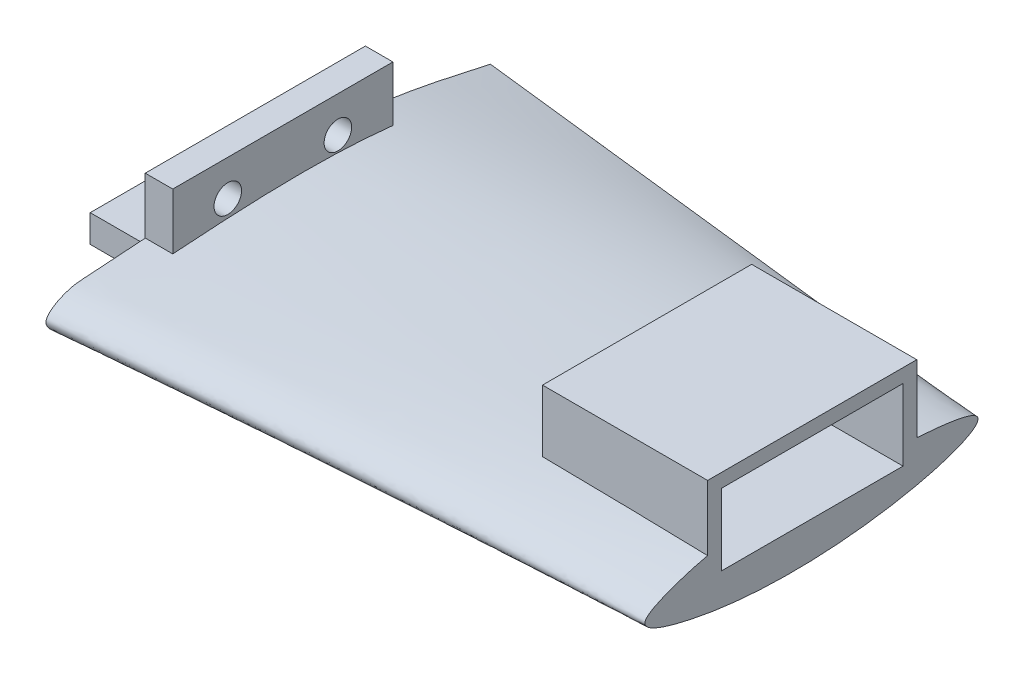
ISO-10303-21;
HEADER;
FILE_DESCRIPTION(('STEP AP214'),'2;1');
FILE_NAME('part.step','',(''),(''),'','','');
FILE_SCHEMA(('AUTOMOTIVE_DESIGN { 1 0 10303 214 1 1 1 1 }'));
ENDSEC;
DATA;
#1=APPLICATION_CONTEXT('core data for automotive mechanical design processes');
#2=APPLICATION_PROTOCOL_DEFINITION('international standard','automotive_design',2000,#1);
#3=PRODUCT_CONTEXT('',#1,'mechanical');
#4=PRODUCT('Part','Part','',(#3));
#5=PRODUCT_RELATED_PRODUCT_CATEGORY('part','',(#4));
#6=PRODUCT_DEFINITION_FORMATION('','',#4);
#7=PRODUCT_DEFINITION_CONTEXT('part definition',#1,'design');
#8=PRODUCT_DEFINITION('design','',#6,#7);
#9=PRODUCT_DEFINITION_SHAPE('','',#8);
#10=(LENGTH_UNIT() NAMED_UNIT(*) SI_UNIT(.MILLI.,.METRE.));
#11=(NAMED_UNIT(*) PLANE_ANGLE_UNIT() SI_UNIT($,.RADIAN.));
#12=(NAMED_UNIT(*) SI_UNIT($,.STERADIAN.) SOLID_ANGLE_UNIT());
#13=UNCERTAINTY_MEASURE_WITH_UNIT(LENGTH_MEASURE(1.E-05),#10,'distance_accuracy_value','');
#14=(GEOMETRIC_REPRESENTATION_CONTEXT(3) GLOBAL_UNCERTAINTY_ASSIGNED_CONTEXT((#13)) GLOBAL_UNIT_ASSIGNED_CONTEXT((#10,
#11,#12)) REPRESENTATION_CONTEXT('',''));
#15=CARTESIAN_POINT('',(0.,0.,0.));
#16=DIRECTION('',(0.,0.,1.));
#17=DIRECTION('',(1.,0.,0.));
#18=AXIS2_PLACEMENT_3D('',#15,#16,#17);
#19=CARTESIAN_POINT('',(5.,2.50713953437616,36.4331531515372));
#20=DIRECTION('',(-1.,0.,0.));
#21=DIRECTION('',(0.,0.,1.));
#22=AXIS2_PLACEMENT_3D('',#19,#20,#21);
#23=PLANE('',#22);
#24=CARTESIAN_POINT('',(5.,0.670017781035461,-41.5522219361151));
#25=CARTESIAN_POINT('',(5.,-2.15381749282778,-28.3974229125445));
#26=CARTESIAN_POINT('',(5.,-6.33825269653964,-8.90428723233303));
#27=CARTESIAN_POINT('',(5.,-5.45305819874797,11.4452681724148));
#28=CARTESIAN_POINT('',(5.,-4.57696734835872,22.5491508166303));
#29=CARTESIAN_POINT('',(5.,-4.30282625476785,28.2636251092626));
#30=CARTESIAN_POINT('',(5.,1.68838787078495,39.5816917799278));
#31=CARTESIAN_POINT('',(5.,5.04856175896063,32.8741280131695));
#32=CARTESIAN_POINT('',(5.,6.24126257710021,13.5850263251158));
#33=CARTESIAN_POINT('',(5.,8.96614142088663,-12.9633955814109));
#34=CARTESIAN_POINT('',(5.,3.57420163670326,-37.0660191623157));
#35=CARTESIAN_POINT('',(5.,2.01005334310638,-44.0579513897247));
#36=B_SPLINE_CURVE_WITH_KNOTS('',3,(#24,#25,#26,#27,#28,#29,#30,#31,#32,#33,#34,#35),
.UNSPECIFIED.,.F.,.F.,(4,1,1,1,1,1,1,1,1,4),(0.,0.246679729653447,0.365536670767572,
0.375933629072026,0.450686325996044,0.495518942891835,0.530258953414261,0.543908419122718,
0.867692352565627,1.),.UNSPECIFIED.);
#37=CARTESIAN_POINT('',(5.,6.00095439193748,18.6518845979224));
#38=VERTEX_POINT('',#37);
#39=CARTESIAN_POINT('',(5.,6.21303473380985,-21.3481154020776));
#40=VERTEX_POINT('',#39);
#41=EDGE_CURVE('E101',#38,#40,#36,.T.);
#42=ORIENTED_EDGE('',*,*,#41,.T.);
#43=DIRECTION('',(0.,1.,0.));
#44=VECTOR('',#43,1.);
#45=CARTESIAN_POINT('',(5.,6.21303473380985,-21.3481154020776));
#46=LINE('',#45,#44);
#47=CARTESIAN_POINT('',(5.,16.2130347338098,-21.3481154020776));
#48=VERTEX_POINT('',#47);
#49=EDGE_CURVE('E96',#40,#48,#46,.T.);
#50=ORIENTED_EDGE('',*,*,#49,.T.);
#51=DIRECTION('',(0.,0.,1.));
#52=VECTOR('',#51,1.);
#53=CARTESIAN_POINT('',(5.,16.2130347338098,-21.3481154020776));
#54=LINE('',#53,#52);
#55=CARTESIAN_POINT('',(5.,16.2130347338098,18.6518845979224));
#56=VERTEX_POINT('',#55);
#57=EDGE_CURVE('E99',#48,#56,#54,.T.);
#58=ORIENTED_EDGE('',*,*,#57,.T.);
#59=DIRECTION('',(0.,-1.,0.));
#60=VECTOR('',#59,1.);
#61=CARTESIAN_POINT('',(5.,16.2130347338098,18.6518845979224));
#62=LINE('',#61,#60);
#63=EDGE_CURVE('E66',#56,#38,#62,.T.);
#64=ORIENTED_EDGE('',*,*,#63,.T.);
#65=EDGE_LOOP('',(#42,#50,#58,#64));
#66=FACE_BOUND('',#65,.T.);
#67=CARTESIAN_POINT('',(5.,9.71303473380984,-11.3481154020776));
#68=DIRECTION('',(1.,0.,0.));
#69=DIRECTION('',(0.,0.,-1.));
#70=AXIS2_PLACEMENT_3D('',#67,#68,#69);
#71=CIRCLE('',#70,2.5);
#72=CARTESIAN_POINT('',(5.,9.71303473380984,-13.8481154020776));
#73=VERTEX_POINT('',#72);
#74=EDGE_CURVE('E117',#73,#73,#71,.T.);
#75=ORIENTED_EDGE('',*,*,#74,.F.);
#76=EDGE_LOOP('',(#75));
#77=FACE_BOUND('',#76,.T.);
#78=CARTESIAN_POINT('',(5.,9.71303473380978,8.65188459792239));
#79=DIRECTION('',(1.,0.,0.));
#80=DIRECTION('',(0.,0.,-1.));
#81=AXIS2_PLACEMENT_3D('',#78,#79,#80);
#82=CIRCLE('',#81,2.49999999999999);
#83=CARTESIAN_POINT('',(5.,9.71303473380978,6.1518845979224));
#84=VERTEX_POINT('',#83);
#85=EDGE_CURVE('E141',#84,#84,#82,.T.);
#86=ORIENTED_EDGE('',*,*,#85,.F.);
#87=EDGE_LOOP('',(#86));
#88=FACE_BOUND('',#87,.T.);
#89=ADVANCED_FACE('F48',(#66,#77,#88),#23,.F.);
#90=CARTESIAN_POINT('',(0.,2.50713953437616,36.4331531515372));
#91=DIRECTION('',(-1.,0.,0.));
#92=DIRECTION('',(0.,0.,1.));
#93=AXIS2_PLACEMENT_3D('',#90,#91,#92);
#94=PLANE('',#93);
#95=CARTESIAN_POINT('',(0.,9.71303473380984,-11.3481154020776));
#96=DIRECTION('',(1.,0.,0.));
#97=DIRECTION('',(0.,0.,-1.));
#98=AXIS2_PLACEMENT_3D('',#95,#96,#97);
#99=CIRCLE('',#98,2.5);
#100=CARTESIAN_POINT('',(0.,9.71303473380984,-13.8481154020776));
#101=VERTEX_POINT('',#100);
#102=EDGE_CURVE('E135',#101,#101,#99,.T.);
#103=ORIENTED_EDGE('',*,*,#102,.T.);
#104=EDGE_LOOP('',(#103));
#105=FACE_BOUND('',#104,.T.);
#106=CARTESIAN_POINT('',(0.,0.670017781035461,-41.5522219361151));
#107=CARTESIAN_POINT('',(0.,-2.15381749282778,-28.3974229125445));
#108=CARTESIAN_POINT('',(0.,-6.33825269653964,-8.90428723233303));
#109=CARTESIAN_POINT('',(0.,-5.45305819874797,11.4452681724148));
#110=CARTESIAN_POINT('',(0.,-4.57696734835872,22.5491508166303));
#111=CARTESIAN_POINT('',(0.,-4.30282625476785,28.2636251092626));
#112=CARTESIAN_POINT('',(0.,1.68838787078495,39.5816917799278));
#113=CARTESIAN_POINT('',(0.,5.04856175896063,32.8741280131695));
#114=CARTESIAN_POINT('',(0.,6.24126257710021,13.5850263251158));
#115=CARTESIAN_POINT('',(0.,8.96614142088663,-12.9633955814109));
#116=CARTESIAN_POINT('',(0.,3.57420163670326,-37.0660191623157));
#117=CARTESIAN_POINT('',(0.,2.01005334310638,-44.0579513897247));
#118=B_SPLINE_CURVE_WITH_KNOTS('',3,(#106,#107,#108,#109,#110,#111,#112,#113,#114,#115,#116,
#117),.UNSPECIFIED.,.F.,.F.,(4,1,1,1,1,1,1,1,1,4),(0.,0.246679729653447,0.365536670767572,
0.375933629072026,0.450686325996044,0.495518942891835,0.530258953414261,0.543908419122718,
0.867692352565627,1.),.UNSPECIFIED.);
#119=CARTESIAN_POINT('',(0.,6.00095439193748,18.6518845979224));
#120=VERTEX_POINT('',#119);
#121=CARTESIAN_POINT('',(0.,6.21303473380985,-21.3481154020776));
#122=VERTEX_POINT('',#121);
#123=EDGE_CURVE('E112',#120,#122,#118,.T.);
#124=ORIENTED_EDGE('',*,*,#123,.F.);
#125=DIRECTION('',(0.,-1.,0.));
#126=VECTOR('',#125,1.);
#127=CARTESIAN_POINT('',(0.,16.2130347338098,18.6518845979224));
#128=LINE('',#127,#126);
#129=CARTESIAN_POINT('',(0.,16.2130347338098,18.6518845979224));
#130=VERTEX_POINT('',#129);
#131=EDGE_CURVE('E89',#130,#120,#128,.T.);
#132=ORIENTED_EDGE('',*,*,#131,.F.);
#133=DIRECTION('',(0.,0.,1.));
#134=VECTOR('',#133,1.);
#135=CARTESIAN_POINT('',(0.,16.2130347338098,-21.3481154020776));
#136=LINE('',#135,#134);
#137=CARTESIAN_POINT('',(0.,16.2130347338098,-21.3481154020776));
#138=VERTEX_POINT('',#137);
#139=EDGE_CURVE('E83',#138,#130,#136,.T.);
#140=ORIENTED_EDGE('',*,*,#139,.F.);
#141=DIRECTION('',(0.,1.,0.));
#142=VECTOR('',#141,1.);
#143=CARTESIAN_POINT('',(0.,6.21303473380985,-21.3481154020776));
#144=LINE('',#143,#142);
#145=EDGE_CURVE('E105',#122,#138,#144,.T.);
#146=ORIENTED_EDGE('',*,*,#145,.F.);
#147=EDGE_LOOP('',(#124,#132,#140,#146));
#148=FACE_BOUND('',#147,.T.);
#149=CARTESIAN_POINT('',(0.,9.71303473380978,8.65188459792239));
#150=DIRECTION('',(1.,0.,0.));
#151=DIRECTION('',(0.,0.,-1.));
#152=AXIS2_PLACEMENT_3D('',#149,#150,#151);
#153=CIRCLE('',#152,2.49999999999999);
#154=CARTESIAN_POINT('',(0.,9.71303473380978,6.1518845979224));
#155=VERTEX_POINT('',#154);
#156=EDGE_CURVE('E144',#155,#155,#153,.T.);
#157=ORIENTED_EDGE('',*,*,#156,.T.);
#158=EDGE_LOOP('',(#157));
#159=FACE_BOUND('',#158,.T.);
#160=ADVANCED_FACE('F128',(#105,#148,#159),#94,.T.);
#161=DIRECTION('',(-1.,0.,0.));
#162=VECTOR('',#161,1.);
#163=SURFACE_OF_LINEAR_EXTRUSION('',#36,#162);
#164=ORIENTED_EDGE('',*,*,#123,.T.);
#165=DIRECTION('',(-1.,0.,0.));
#166=VECTOR('',#165,1.);
#167=CARTESIAN_POINT('',(5.,6.21303473380985,-21.3481154020776));
#168=LINE('',#167,#166);
#169=EDGE_CURVE('E12',#40,#122,#168,.T.);
#170=ORIENTED_EDGE('',*,*,#169,.F.);
#171=ORIENTED_EDGE('',*,*,#41,.F.);
#172=DIRECTION('',(-1.,0.,0.));
#173=VECTOR('',#172,1.);
#174=CARTESIAN_POINT('',(5.,6.00095439193748,18.6518845979224));
#175=LINE('',#174,#173);
#176=EDGE_CURVE('E109',#38,#120,#175,.T.);
#177=ORIENTED_EDGE('',*,*,#176,.T.);
#178=EDGE_LOOP('',(#164,#170,#171,#177));
#179=FACE_BOUND('',#178,.T.);
#180=ADVANCED_FACE('F50',(#179),#163,.F.);
#181=CARTESIAN_POINT('',(5.,6.21303473380985,-21.3481154020776));
#182=DIRECTION('',(0.,0.,1.));
#183=DIRECTION('',(1.,0.,0.));
#184=AXIS2_PLACEMENT_3D('',#181,#182,#183);
#185=PLANE('',#184);
#186=ORIENTED_EDGE('',*,*,#145,.T.);
#187=DIRECTION('',(-1.,0.,0.));
#188=VECTOR('',#187,1.);
#189=CARTESIAN_POINT('',(5.,16.2130347338098,-21.3481154020776));
#190=LINE('',#189,#188);
#191=EDGE_CURVE('E58',#48,#138,#190,.T.);
#192=ORIENTED_EDGE('',*,*,#191,.F.);
#193=ORIENTED_EDGE('',*,*,#49,.F.);
#194=ORIENTED_EDGE('',*,*,#169,.T.);
#195=EDGE_LOOP('',(#186,#192,#193,#194));
#196=FACE_BOUND('',#195,.T.);
#197=ADVANCED_FACE('F104',(#196),#185,.F.);
#198=CARTESIAN_POINT('',(5.,16.2130347338098,-21.3481154020776));
#199=DIRECTION('',(0.,-1.,0.));
#200=DIRECTION('',(0.,0.,-1.));
#201=AXIS2_PLACEMENT_3D('',#198,#199,#200);
#202=PLANE('',#201);
#203=ORIENTED_EDGE('',*,*,#139,.T.);
#204=DIRECTION('',(-1.,0.,0.));
#205=VECTOR('',#204,1.);
#206=CARTESIAN_POINT('',(5.,16.2130347338098,18.6518845979224));
#207=LINE('',#206,#205);
#208=EDGE_CURVE('E106',#56,#130,#207,.T.);
#209=ORIENTED_EDGE('',*,*,#208,.F.);
#210=ORIENTED_EDGE('',*,*,#57,.F.);
#211=ORIENTED_EDGE('',*,*,#191,.T.);
#212=EDGE_LOOP('',(#203,#209,#210,#211));
#213=FACE_BOUND('',#212,.T.);
#214=ADVANCED_FACE('F107',(#213),#202,.F.);
#215=CARTESIAN_POINT('',(5.,16.2130347338098,18.6518845979224));
#216=DIRECTION('',(0.,0.,-1.));
#217=DIRECTION('',(0.,1.,0.));
#218=AXIS2_PLACEMENT_3D('',#215,#216,#217);
#219=PLANE('',#218);
#220=ORIENTED_EDGE('',*,*,#131,.T.);
#221=ORIENTED_EDGE('',*,*,#176,.F.);
#222=ORIENTED_EDGE('',*,*,#63,.F.);
#223=ORIENTED_EDGE('',*,*,#208,.T.);
#224=EDGE_LOOP('',(#220,#221,#222,#223));
#225=FACE_BOUND('',#224,.T.);
#226=ADVANCED_FACE('F125',(#225),#219,.F.);
#227=CARTESIAN_POINT('',(5.,9.71303473380984,-11.3481154020776));
#228=DIRECTION('',(-1.,0.,0.));
#229=DIRECTION('',(0.,0.,1.));
#230=AXIS2_PLACEMENT_3D('',#227,#228,#229);
#231=CYLINDRICAL_SURFACE('',#230,2.5);
#232=ORIENTED_EDGE('',*,*,#74,.T.);
#233=EDGE_LOOP('',(#232));
#234=FACE_BOUND('',#233,.T.);
#235=ORIENTED_EDGE('',*,*,#102,.F.);
#236=EDGE_LOOP('',(#235));
#237=FACE_BOUND('',#236,.T.);
#238=ADVANCED_FACE('F161',(#234,#237),#231,.F.);
#239=CARTESIAN_POINT('',(5.,9.71303473380978,8.65188459792239));
#240=DIRECTION('',(-1.,0.,0.));
#241=DIRECTION('',(0.,0.,1.));
#242=AXIS2_PLACEMENT_3D('',#239,#240,#241);
#243=CYLINDRICAL_SURFACE('',#242,2.49999999999999);
#244=ORIENTED_EDGE('',*,*,#85,.T.);
#245=EDGE_LOOP('',(#244));
#246=FACE_BOUND('',#245,.T.);
#247=ORIENTED_EDGE('',*,*,#156,.F.);
#248=EDGE_LOOP('',(#247));
#249=FACE_BOUND('',#248,.T.);
#250=ADVANCED_FACE('F150',(#246,#249),#243,.F.);
#251=CLOSED_SHELL('',(#89,#160,#180,#197,#214,#226,#238,#250));
#252=MANIFOLD_SOLID_BREP('B2',#251);
#253=CARTESIAN_POINT('',(100.,0.241226580026939,27.828988034186));
#254=DIRECTION('',(-1.,0.,0.));
#255=DIRECTION('',(0.,0.,1.));
#256=AXIS2_PLACEMENT_3D('',#253,#254,#255);
#257=PLANE('',#256);
#258=DIRECTION('',(0.,0.,1.));
#259=VECTOR('',#258,1.);
#260=CARTESIAN_POINT('',(100.,14.2778003560675,-19.0254715143699));
#261=LINE('',#260,#259);
#262=CARTESIAN_POINT('',(100.,14.2778003560675,-19.0254715143699));
#263=VERTEX_POINT('',#262);
#264=CARTESIAN_POINT('',(100.,14.2778003560675,13.9745284856301));
#265=VERTEX_POINT('',#264);
#266=EDGE_CURVE('E384',#263,#265,#261,.T.);
#267=ORIENTED_EDGE('',*,*,#266,.F.);
#268=DIRECTION('',(0.,1.,0.));
#269=VECTOR('',#268,1.);
#270=CARTESIAN_POINT('',(100.,14.2778003560675,-19.0254715143699));
#271=LINE('',#270,#269);
#272=CARTESIAN_POINT('',(100.,1.27780035606751,-19.0254715143699));
#273=VERTEX_POINT('',#272);
#274=EDGE_CURVE('E251',#273,#263,#271,.T.);
#275=ORIENTED_EDGE('',*,*,#274,.F.);
#276=DIRECTION('',(0.,0.,-1.));
#277=VECTOR('',#276,1.);
#278=CARTESIAN_POINT('',(100.,1.27780035606751,-19.0254715143699));
#279=LINE('',#278,#277);
#280=CARTESIAN_POINT('',(100.,1.2778003560675,13.9745284856301));
#281=VERTEX_POINT('',#280);
#282=EDGE_CURVE('E373',#281,#273,#279,.T.);
#283=ORIENTED_EDGE('',*,*,#282,.F.);
#284=DIRECTION('',(0.,-1.,0.));
#285=VECTOR('',#284,1.);
#286=CARTESIAN_POINT('',(100.,14.2778003560675,13.9745284856301));
#287=LINE('',#286,#285);
#288=EDGE_CURVE('E387',#265,#281,#287,.T.);
#289=ORIENTED_EDGE('',*,*,#288,.F.);
#290=EDGE_LOOP('',(#267,#275,#283,#289));
#291=FACE_BOUND('',#290,.T.);
#292=CARTESIAN_POINT('',(100.,2.69667764909239,-32.0853454657688));
#293=CARTESIAN_POINT('',(100.,4.78551240487685,-28.8518464478132));
#294=CARTESIAN_POINT('',(100.,4.9928317056501,0.507424432519159));
#295=CARTESIAN_POINT('',(100.,6.59077299829616,14.6279801013047));
#296=CARTESIAN_POINT('',(100.,-0.25272816173216,31.3120706628029));
#297=CARTESIAN_POINT('',(100.,-10.480073227243,-0.382333003836035));
#298=CARTESIAN_POINT('',(100.,-0.658784661904674,-37.279573519161));
#299=CARTESIAN_POINT('',(100.,2.69667764909239,-32.0853454657688));
#300=B_SPLINE_CURVE_WITH_KNOTS('',3,(#292,#293,#294,#295,#296,#297,#298,#299),.UNSPECIFIED.,.T.,
.F.,(4,1,1,1,1,4),(0.,0.267498485663837,0.448405279002374,0.499167356659517,0.570295790795233,
1.),.UNSPECIFIED.);
#301=CARTESIAN_POINT('',(100.,1.89344153886163,-32.6503258572084));
#302=VERTEX_POINT('',#301);
#303=CARTESIAN_POINT('',(100.,4.49749333258747,-21.5254715143699));
#304=VERTEX_POINT('',#303);
#305=EDGE_CURVE('E442',#302,#304,#300,.T.);
#306=ORIENTED_EDGE('',*,*,#305,.T.);
#307=DIRECTION('',(0.,1.,0.));
#308=VECTOR('',#307,1.);
#309=CARTESIAN_POINT('',(100.,-1.22219964393252,-21.5254715143699));
#310=LINE('',#309,#308);
#311=CARTESIAN_POINT('',(100.,16.7778003560675,-21.5254715143699));
#312=VERTEX_POINT('',#311);
#313=EDGE_CURVE('E394',#304,#312,#310,.T.);
#314=ORIENTED_EDGE('',*,*,#313,.T.);
#315=DIRECTION('',(0.,0.,1.));
#316=VECTOR('',#315,1.);
#317=CARTESIAN_POINT('',(100.,16.7778003560675,-21.5254715143699));
#318=LINE('',#317,#316);
#319=CARTESIAN_POINT('',(100.,16.7778003560675,16.4745284856301));
#320=VERTEX_POINT('',#319);
#321=EDGE_CURVE('E411',#312,#320,#318,.T.);
#322=ORIENTED_EDGE('',*,*,#321,.T.);
#323=DIRECTION('',(0.,-1.,0.));
#324=VECTOR('',#323,1.);
#325=CARTESIAN_POINT('',(100.,-1.22219964393253,16.4745284856301));
#326=LINE('',#325,#324);
#327=CARTESIAN_POINT('',(100.,4.94618219345007,16.4745284856301));
#328=VERTEX_POINT('',#327);
#329=EDGE_CURVE('E403',#320,#328,#326,.T.);
#330=ORIENTED_EDGE('',*,*,#329,.T.);
#331=CARTESIAN_POINT('',(100.,1.84343696999674,-32.6494708497884));
#332=VERTEX_POINT('',#331);
#333=EDGE_CURVE('E434',#328,#332,#300,.T.);
#334=ORIENTED_EDGE('',*,*,#333,.T.);
#335=EDGE_CURVE('E437',#332,#302,#300,.T.);
#336=ORIENTED_EDGE('',*,*,#335,.T.);
#337=EDGE_LOOP('',(#306,#314,#322,#330,#334,#336));
#338=FACE_BOUND('',#337,.T.);
#339=ADVANCED_FACE('F224',(#291,#338),#257,.F.);
#340=CARTESIAN_POINT('',(0.,2.50713953437616,36.4331531515372));
#341=DIRECTION('',(-1.,0.,0.));
#342=DIRECTION('',(0.,0.,1.));
#343=AXIS2_PLACEMENT_3D('',#340,#341,#342);
#344=PLANE('',#343);
#345=DIRECTION('',(0.,0.,-1.));
#346=VECTOR('',#345,1.);
#347=CARTESIAN_POINT('',(0.,0.,18.6518845979224));
#348=LINE('',#347,#346);
#349=CARTESIAN_POINT('',(0.,0.,18.6518845979224));
#350=VERTEX_POINT('',#349);
#351=CARTESIAN_POINT('',(0.,0.,-21.3481154020776));
#352=VERTEX_POINT('',#351);
#353=EDGE_CURVE('E331',#350,#352,#348,.T.);
#354=ORIENTED_EDGE('',*,*,#353,.T.);
#355=DIRECTION('',(0.,1.,0.));
#356=VECTOR('',#355,1.);
#357=CARTESIAN_POINT('',(0.,0.,-21.3481154020776));
#358=LINE('',#357,#356);
#359=CARTESIAN_POINT('',(0.,5.,-21.3481154020776));
#360=VERTEX_POINT('',#359);
#361=EDGE_CURVE('E341',#352,#360,#358,.T.);
#362=ORIENTED_EDGE('',*,*,#361,.T.);
#363=DIRECTION('',(0.,0.,1.));
#364=VECTOR('',#363,1.);
#365=CARTESIAN_POINT('',(0.,5.,8.6518845979224));
#366=LINE('',#365,#364);
#367=CARTESIAN_POINT('',(0.,5.,18.6518845979224));
#368=VERTEX_POINT('',#367);
#369=EDGE_CURVE('E354',#360,#368,#366,.T.);
#370=ORIENTED_EDGE('',*,*,#369,.T.);
#371=DIRECTION('',(0.,1.,0.));
#372=VECTOR('',#371,1.);
#373=CARTESIAN_POINT('',(0.,0.,18.6518845979224));
#374=LINE('',#373,#372);
#375=EDGE_CURVE('E353',#350,#368,#374,.T.);
#376=ORIENTED_EDGE('',*,*,#375,.F.);
#377=EDGE_LOOP('',(#354,#362,#370,#376));
#378=FACE_BOUND('',#377,.T.);
#379=CARTESIAN_POINT('',(0.,2.01005334310638,-44.0579513897247));
#380=CARTESIAN_POINT('',(0.,3.57420163670326,-37.0660191623157));
#381=CARTESIAN_POINT('',(0.,8.96614142088663,-12.9633955814109));
#382=CARTESIAN_POINT('',(0.,6.24126257710021,13.5850263251158));
#383=CARTESIAN_POINT('',(0.,5.04856175896063,32.8741280131695));
#384=CARTESIAN_POINT('',(0.,1.68838787078495,39.5816917799278));
#385=CARTESIAN_POINT('',(0.,-4.30282625476785,28.2636251092626));
#386=CARTESIAN_POINT('',(0.,-4.57696734835872,22.5491508166303));
#387=CARTESIAN_POINT('',(0.,-5.45305819874797,11.4452681724148));
#388=CARTESIAN_POINT('',(0.,-6.33825269653964,-8.90428723233303));
#389=CARTESIAN_POINT('',(0.,-2.15381749282778,-28.3974229125445));
#390=CARTESIAN_POINT('',(0.,0.670017781035461,-41.5522219361151));
#391=B_SPLINE_CURVE_WITH_KNOTS('',3,(#379,#380,#381,#382,#383,#384,#385,#386,#387,#388,#389,
#390),.UNSPECIFIED.,.F.,.F.,(4,1,1,1,1,1,1,1,1,4),(0.,0.132307647434373,0.456091580877282,
0.469741046585739,0.504481057108165,0.549313674003956,0.624066370927974,0.634463329232428,
0.753320270346553,1.),.UNSPECIFIED.);
#392=CARTESIAN_POINT('',(0.,2.01005334310638,-44.0579513897247));
#393=VERTEX_POINT('',#392);
#394=CARTESIAN_POINT('',(0.,0.67001778103546,-41.5522219361151));
#395=VERTEX_POINT('',#394);
#396=EDGE_CURVE('E417',#393,#395,#391,.T.);
#397=ORIENTED_EDGE('',*,*,#396,.F.);
#398=DIRECTION('',(0.,0.471587033305201,-0.881819522361803));
#399=VECTOR('',#398,1.);
#400=CARTESIAN_POINT('',(0.,2.01005334310638,-44.0579513897247));
#401=LINE('',#400,#399);
#402=EDGE_CURVE('E424',#395,#393,#401,.T.);
#403=ORIENTED_EDGE('',*,*,#402,.F.);
#404=EDGE_LOOP('',(#397,#403));
#405=FACE_BOUND('',#404,.T.);
#406=ADVANCED_FACE('F351',(#378,#405),#344,.T.);
#407=CARTESIAN_POINT('',(0.,0.67001778103546,-41.5522219361151));
#408=CARTESIAN_POINT('',(100.,1.84343697002639,-32.6494708497899));
#409=CARTESIAN_POINT('',(0.,0.893357041380611,-41.9698435117167));
#410=CARTESIAN_POINT('',(100.,1.85180248317696,-32.649904434454));
#411=CARTESIAN_POINT('',(0.,1.11669630172576,-42.3874650873183));
#412=CARTESIAN_POINT('',(100.,1.86015240204051,-32.6501927345225));
#413=CARTESIAN_POINT('',(0.,1.56337482241607,-43.2227082385215));
#414=CARTESIAN_POINT('',(100.,1.87682070653745,-32.6504779941136));
#415=CARTESIAN_POINT('',(0.,1.78671408276123,-43.6403298141231));
#416=CARTESIAN_POINT('',(100.,1.88513909217085,-32.6504749536362));
#417=CARTESIAN_POINT('',(0.,2.01005334310638,-44.0579513897247));
#418=CARTESIAN_POINT('',(100.,1.89344153886115,-32.6503258572084));
#419=B_SPLINE_SURFACE_WITH_KNOTS('',3,1,((#407,#408),(#409,#410),(#411,#412),(#413,#414),(#415,
#416),(#417,#418)),.UNSPECIFIED.,.F.,.F.,.F.,(4,2,4),(2,2),(0.,0.5,1.),(0.,1.),.UNSPECIFIED.);
#420=DIRECTION('',(0.993555461834041,-0.00115860295022176,0.11334108654389));
#421=VECTOR('',#420,1.);
#422=CARTESIAN_POINT('',(50.,1.95174744098376,-38.3541386234665));
#423=LINE('',#422,#421);
#424=EDGE_CURVE('E431',#393,#302,#423,.T.);
#425=DIRECTION('',(-0.995992425877088,-0.011687166246138,-0.0886707265144888));
#426=VECTOR('',#425,1.);
#427=CARTESIAN_POINT('',(50.,1.25672737553092,-37.1008463929525));
#428=LINE('',#427,#426);
#429=EDGE_CURVE('E430',#332,#395,#428,.T.);
#430=ORIENTED_EDGE('',*,*,#402,.T.);
#431=ORIENTED_EDGE('',*,*,#424,.T.);
#432=ORIENTED_EDGE('',*,*,#335,.F.);
#433=ORIENTED_EDGE('',*,*,#429,.T.);
#434=EDGE_LOOP('',(#430,#431,#432,#433));
#435=FACE_BOUND('',#434,.T.);
#436=ADVANCED_FACE('F483',(#435),#419,.T.);
#437=CARTESIAN_POINT('',(0.,2.01005334310638,-44.0579513897247));
#438=CARTESIAN_POINT('',(100.,1.89344153886115,-32.6503258572084));
#439=CARTESIAN_POINT('',(0.,2.3793318447662,-42.4072317826297));
#440=CARTESIAN_POINT('',(100.,2.18301326188215,-32.6451256901849));
#441=CARTESIAN_POINT('',(0.,3.94348013836308,-35.4152995552207));
#442=CARTESIAN_POINT('',(100.,3.32742201746055,-31.8705357113242));
#443=CARTESIAN_POINT('',(0.,7.11967163510052,-19.5277998577188));
#444=CARTESIAN_POINT('',(100.,4.83215894271919,-22.2460536681009));
#445=CARTESIAN_POINT('',(0.,7.2304574990802,3.94732658062879));
#446=CARTESIAN_POINT('',(100.,5.28958362019169,1.97315933979371));
#447=CARTESIAN_POINT('',(0.,5.70637917415237,22.2354944004262));
#448=CARTESIAN_POINT('',(100.,6.31783466035235,12.1805410273719));
#449=CARTESIAN_POINT('',(0.,5.12559033991367,31.6283737483178));
#450=CARTESIAN_POINT('',(100.,3.92652317502868,20.404614057541));
#451=CARTESIAN_POINT('',(0.,4.17075204188472,34.6264077606808));
#452=CARTESIAN_POINT('',(100.,3.1653993495298,22.7225990810644));
#453=CARTESIAN_POINT('',(0.,1.9289515003873,37.8525041579322));
#454=CARTESIAN_POINT('',(100.,1.95984185397396,25.9179430587471));
#455=CARTESIAN_POINT('',(0.,-0.701369452715601,35.0671756656178));
#456=CARTESIAN_POINT('',(100.,0.461059215772915,28.1826589707466));
#457=CARTESIAN_POINT('',(0.,-3.70133003152518,28.5206697209574));
#458=CARTESIAN_POINT('',(100.,-1.52737006822024,27.3619726798099));
#459=CARTESIAN_POINT('',(0.,-4.50966786336259,23.9520093661469));
#460=CARTESIAN_POINT('',(100.,-3.11749599147706,21.9871559824959));
#461=CARTESIAN_POINT('',(0.,-4.80560261144826,19.6513473199409));
#462=CARTESIAN_POINT('',(100.,-4.0938893638968,16.8484523212607));
#463=CARTESIAN_POINT('',(0.,-5.45305819874797,11.4452681724148));
#464=CARTESIAN_POINT('',(100.,-5.48236109004198,7.65021943680065));
#465=CARTESIAN_POINT('',(0.,-6.33825269653964,-8.90428723233303));
#466=CARTESIAN_POINT('',(100.,-5.62822643908141,-16.0202269175019));
#467=CARTESIAN_POINT('',(0.,-2.15381749282778,-28.3974229125445));
#468=CARTESIAN_POINT('',(100.,-0.460735893347618,-32.5300455379343));
#469=CARTESIAN_POINT('',(0.,0.670017781035461,-41.5522219361151));
#470=CARTESIAN_POINT('',(100.,1.8434369700266,-32.6494708497899));
#471=B_SPLINE_SURFACE_WITH_KNOTS('',3,1,((#437,#438),(#439,#440),(#441,#442),(#443,#444),(#445,
#446),(#447,#448),(#449,#450),(#451,#452),(#453,#454),(#455,#456),(#457,#458),(#459,#460),(#461,
#462),(#463,#464),(#465,#466),(#467,#468),(#469,#470)),.UNSPECIFIED.,.F.,.F.,.F.,(4,1,1,1,1,1,1,
1,1,1,1,1,1,1,4),(2,2),(0.,0.0312364051431127,0.132307647434373,0.299214030682716,
0.456091580877282,0.469741046585739,0.480444861962142,0.504481057108165,0.531297864005351,
0.549313674003956,0.602553702485097,0.624066370927974,0.634463329232428,0.753320270346553,1.),
(0.,1.),.UNSPECIFIED.);
#472=CARTESIAN_POINT('',(100.,4.49749333258709,-21.5254715143726));
#473=CARTESIAN_POINT('',(99.0080565409106,4.51466694005524,-21.5254715143714));
#474=CARTESIAN_POINT('',(98.0161128692091,4.5318282691401,-21.5254715143705));
#475=CARTESIAN_POINT('',(93.0563934593656,4.61757436737896,-21.5254715143673));
#476=CARTESIAN_POINT('',(89.0886145799777,4.68597749475548,-21.5254715143684));
#477=CARTESIAN_POINT('',(80.0805599733576,4.84085777111192,-21.5254715143717));
#478=CARTESIAN_POINT('',(75.040282315461,4.92722265709423,-21.5254715143741));
#479=CARTESIAN_POINT('',(70.,5.01331450247861,-21.5254715143699));
#480=B_SPLINE_CURVE_WITH_KNOTS('',3,(#472,#473,#474,#475,#476,#477,#478,#479),.UNSPECIFIED.,.F.,
.F.,(4,2,2,4),(0.,2.97627633625917,14.8813816940603,30.0044342518654),.UNSPECIFIED.);
#481=CARTESIAN_POINT('',(70.,5.01331450247861,-21.5254715143699));
#482=VERTEX_POINT('',#481);
#483=EDGE_CURVE('E46',#304,#482,#480,.T.);
#484=CARTESIAN_POINT('',(70.,5.51480375306359,16.4745284856301));
#485=CARTESIAN_POINT('',(71.2501418025845,5.49865586773085,16.4745284856301));
#486=CARTESIAN_POINT('',(72.5002754680942,5.48185719337385,16.4745284856301));
#487=CARTESIAN_POINT('',(75.0005117992138,5.44675019499368,16.4745284856301));
#488=CARTESIAN_POINT('',(76.2506144649895,5.42844188275573,16.4745284856301));
#489=CARTESIAN_POINT('',(78.7507857622766,5.39010741138932,16.4745284856301));
#490=CARTESIAN_POINT('',(80.000854393952,5.37008126301559,16.4745284856301));
#491=CARTESIAN_POINT('',(82.5009541385526,5.32808627165822,16.4745284856301));
#492=CARTESIAN_POINT('',(83.7509852516077,5.30611743643669,16.4745284856301));
#493=CARTESIAN_POINT('',(86.2510105849183,5.26000187971415,16.4745284856301));
#494=CARTESIAN_POINT('',(87.5010048050734,5.23585515275628,16.4745284856301));
#495=CARTESIAN_POINT('',(90.0009467375,5.18513948006022,16.4745284856301));
#496=CARTESIAN_POINT('',(91.2508944496739,5.15857052949382,16.4745284856301));
#497=CARTESIAN_POINT('',(93.7507378697544,5.10275974941553,16.4745284856301));
#498=CARTESIAN_POINT('',(95.000633577309,5.07351790406687,16.4745284856301));
#499=CARTESIAN_POINT('',(97.5003669482899,5.01210797785042,16.4745284856301));
#500=CARTESIAN_POINT('',(98.7502046109137,4.97993986436333,16.4745284856301));
#501=CARTESIAN_POINT('',(100.,4.94618219345008,16.4745284856301));
#502=B_SPLINE_CURVE_WITH_KNOTS('',3,(#484,#485,#486,#487,#488,#489,#490,#491,#492,#493,#494,
#495,#496,#497,#498,#499,#500,#501),.UNSPECIFIED.,.F.,.F.,(4,2,2,2,2,2,2,2,4),(0.,
3.75073849633461,7.50144771474376,11.2521334531219,15.0028042061179,18.7534843569429,
22.5041719841876,26.2548818355412,30.005633501435),.UNSPECIFIED.);
#503=CARTESIAN_POINT('',(70.,5.51480375306359,16.4745284856301));
#504=VERTEX_POINT('',#503);
#505=EDGE_CURVE('E236',#504,#328,#502,.T.);
#506=CARTESIAN_POINT('',(70.,5.51480375306359,16.4745284856301));
#507=CARTESIAN_POINT('',(70.,5.54323876297479,16.2147948089656));
#508=CARTESIAN_POINT('',(70.,5.57006308732267,15.9548879553662));
#509=CARTESIAN_POINT('',(70.,5.62056861046145,15.4347723945593));
#510=CARTESIAN_POINT('',(70.,5.64424985144229,15.1745636914508));
#511=CARTESIAN_POINT('',(70.,5.71063281991407,14.3943000816554));
#512=CARTESIAN_POINT('',(70.,5.74875621941414,13.8738502214069));
#513=CARTESIAN_POINT('',(70.,5.81370600817251,12.8326913627499));
#514=CARTESIAN_POINT('',(70.,5.84054169949117,12.3119829331554));
#515=CARTESIAN_POINT('',(70.,5.88423650766929,11.2703325430766));
#516=CARTESIAN_POINT('',(70.,5.90109901142284,10.7493907220664));
#517=CARTESIAN_POINT('',(70.,5.92638421351818,9.70731725359945));
#518=CARTESIAN_POINT('',(70.,5.9348070061238,9.18618560832782));
#519=CARTESIAN_POINT('',(70.,5.94487946785685,8.14421335395076));
#520=CARTESIAN_POINT('',(70.,5.94653367115089,7.62337278378437));
#521=CARTESIAN_POINT('',(70.,5.94479043547331,6.58158496695674));
#522=CARTESIAN_POINT('',(70.,5.94139182637049,6.06063772352855));
#523=CARTESIAN_POINT('',(70.,5.93119854559325,5.01866713443534));
#524=CARTESIAN_POINT('',(70.,5.92440313870645,4.4976437967176));
#525=CARTESIAN_POINT('',(70.,5.90895806208254,3.45555294857756));
#526=CARTESIAN_POINT('',(70.,5.90030813143348,2.93448544226297));
#527=CARTESIAN_POINT('',(70.,5.88695706393392,2.15288158744583));
#528=CARTESIAN_POINT('',(70.,5.8824439286676,1.89234187145112));
#529=CARTESIAN_POINT('',(70.,5.87345761446883,1.37126174845881));
#530=CARTESIAN_POINT('',(70.,5.86898443553418,1.11072134146125));
#531=CARTESIAN_POINT('',(70.,5.85385924367621,0.228416677510402));
#532=CARTESIAN_POINT('',(70.,5.84323905857097,-0.393348166222473));
#533=CARTESIAN_POINT('',(70.,5.82144349907993,-1.63686795764511));
#534=CARTESIAN_POINT('',(70.,5.8102681247194,-2.25862290533531));
#535=CARTESIAN_POINT('',(70.,5.77511877255243,-4.12362546054622));
#536=CARTESIAN_POINT('',(70.,5.74951797649067,-5.3668445149913));
#537=CARTESIAN_POINT('',(70.,5.69006204238727,-7.8528957743954));
#538=CARTESIAN_POINT('',(70.,5.65620820573931,-9.0957280094432));
#539=CARTESIAN_POINT('',(70.,5.57617001379893,-11.5822742237351));
#540=CARTESIAN_POINT('',(70.,5.52997322965444,-12.8259878244568));
#541=CARTESIAN_POINT('',(70.,5.44768353004495,-14.6911055950747));
#542=CARTESIAN_POINT('',(70.,5.41808439638893,-15.3127959885274));
#543=CARTESIAN_POINT('',(70.,5.35375645366534,-16.5559060933991));
#544=CARTESIAN_POINT('',(70.,5.31902770655024,-17.1773258079964));
#545=CARTESIAN_POINT('',(70.,5.24348611004591,-18.4201720598724));
#546=CARTESIAN_POINT('',(70.,5.2026696484029,-19.0415983806657));
#547=CARTESIAN_POINT('',(70.,5.13601181119119,-19.9733613076261));
#548=CARTESIAN_POINT('',(70.,5.11288644843445,-20.2838929107851));
#549=CARTESIAN_POINT('',(70.,5.06464170191083,-20.9048035525923));
#550=CARTESIAN_POINT('',(70.,5.03952230174539,-21.2151825899647));
#551=CARTESIAN_POINT('',(70.,5.01331450247862,-21.5254715143699));
#552=B_SPLINE_CURVE_WITH_KNOTS('',3,(#506,#507,#508,#509,#510,#511,#512,#513,#514,#515,#516,
#517,#518,#519,#520,#521,#522,#523,#524,#525,#526,#527,#528,#529,#530,#531,#532,#533,#534,#535,
#536,#537,#538,#539,#540,#541,#542,#543,#544,#545,#546,#547,#548,#549,#550,#551),.UNSPECIFIED.,
.F.,.F.,(4,2,2,2,2,2,2,2,2,2,2,2,2,2,2,2,2,2,2,2,2,2,4),(0.,0.783845904869551,1.56768128702826,
3.13306687139119,4.69715990143781,6.2607214601081,7.824265555036,9.38676208585467,
10.9496205162652,12.5128173626722,14.0762342788873,14.8579707325463,15.6397071430635,
17.5052735370339,19.3708398461072,23.1012711787898,26.8311146525989,30.5647281770161,
32.431894958864,34.2990391920109,36.1672957688316,37.1014645133103,38.0356409409987),.UNSPECIFIED.);
#553=EDGE_CURVE('E441',#504,#482,#552,.T.);
#554=ORIENTED_EDGE('',*,*,#483,.F.);
#555=ORIENTED_EDGE('',*,*,#305,.F.);
#556=ORIENTED_EDGE('',*,*,#424,.F.);
#557=ORIENTED_EDGE('',*,*,#396,.T.);
#558=ORIENTED_EDGE('',*,*,#429,.F.);
#559=ORIENTED_EDGE('',*,*,#333,.F.);
#560=ORIENTED_EDGE('',*,*,#505,.F.);
#561=ORIENTED_EDGE('',*,*,#553,.T.);
#562=EDGE_LOOP('',(#554,#555,#556,#557,#558,#559,#560,#561));
#563=FACE_BOUND('',#562,.T.);
#564=ADVANCED_FACE('F457',(#563),#471,.T.);
#565=CARTESIAN_POINT('',(70.,-1.22219964393252,-21.5254715143699));
#566=DIRECTION('',(0.,0.,-1.));
#567=DIRECTION('',(-1.,0.,0.));
#568=AXIS2_PLACEMENT_3D('',#565,#566,#567);
#569=PLANE('',#568);
#570=ORIENTED_EDGE('',*,*,#313,.F.);
#571=ORIENTED_EDGE('',*,*,#483,.T.);
#572=DIRECTION('',(0.,1.,0.));
#573=VECTOR('',#572,1.);
#574=CARTESIAN_POINT('',(70.,-1.22219964393252,-21.5254715143699));
#575=LINE('',#574,#573);
#576=CARTESIAN_POINT('',(70.,16.7778003560675,-21.5254715143699));
#577=VERTEX_POINT('',#576);
#578=EDGE_CURVE('E400',#482,#577,#575,.T.);
#579=ORIENTED_EDGE('',*,*,#578,.T.);
#580=DIRECTION('',(1.,0.,0.));
#581=VECTOR('',#580,1.);
#582=CARTESIAN_POINT('',(70.,16.7778003560675,-21.5254715143699));
#583=LINE('',#582,#581);
#584=EDGE_CURVE('E409',#577,#312,#583,.T.);
#585=ORIENTED_EDGE('',*,*,#584,.T.);
#586=EDGE_LOOP('',(#570,#571,#579,#585));
#587=FACE_BOUND('',#586,.T.);
#588=ADVANCED_FACE('F474',(#587),#569,.T.);
#589=CARTESIAN_POINT('',(70.,-1.22219964393253,16.4745284856301));
#590=DIRECTION('',(0.,0.,1.));
#591=DIRECTION('',(1.,0.,0.));
#592=AXIS2_PLACEMENT_3D('',#589,#590,#591);
#593=PLANE('',#592);
#594=DIRECTION('',(0.,-1.,0.));
#595=VECTOR('',#594,1.);
#596=CARTESIAN_POINT('',(70.,-1.22219964393253,16.4745284856301));
#597=LINE('',#596,#595);
#598=CARTESIAN_POINT('',(70.,16.7778003560675,16.4745284856301));
#599=VERTEX_POINT('',#598);
#600=EDGE_CURVE('E406',#599,#504,#597,.T.);
#601=ORIENTED_EDGE('',*,*,#600,.T.);
#602=ORIENTED_EDGE('',*,*,#505,.T.);
#603=ORIENTED_EDGE('',*,*,#329,.F.);
#604=DIRECTION('',(1.,0.,0.));
#605=VECTOR('',#604,1.);
#606=CARTESIAN_POINT('',(70.,16.7778003560675,16.4745284856301));
#607=LINE('',#606,#605);
#608=EDGE_CURVE('E415',#599,#320,#607,.T.);
#609=ORIENTED_EDGE('',*,*,#608,.F.);
#610=EDGE_LOOP('',(#601,#602,#603,#609));
#611=FACE_BOUND('',#610,.T.);
#612=ADVANCED_FACE('F470',(#611),#593,.T.);
#613=CARTESIAN_POINT('',(70.,16.7778003560675,-21.5254715143699));
#614=DIRECTION('',(0.,1.,0.));
#615=DIRECTION('',(0.,0.,1.));
#616=AXIS2_PLACEMENT_3D('',#613,#614,#615);
#617=PLANE('',#616);
#618=ORIENTED_EDGE('',*,*,#321,.F.);
#619=ORIENTED_EDGE('',*,*,#584,.F.);
#620=DIRECTION('',(0.,0.,1.));
#621=VECTOR('',#620,1.);
#622=CARTESIAN_POINT('',(70.,16.7778003560675,-21.5254715143699));
#623=LINE('',#622,#621);
#624=EDGE_CURVE('E402',#577,#599,#623,.T.);
#625=ORIENTED_EDGE('',*,*,#624,.T.);
#626=ORIENTED_EDGE('',*,*,#608,.T.);
#627=EDGE_LOOP('',(#618,#619,#625,#626));
#628=FACE_BOUND('',#627,.T.);
#629=ADVANCED_FACE('F467',(#628),#617,.T.);
#630=CARTESIAN_POINT('',(70.,0.,0.));
#631=DIRECTION('',(1.,0.,0.));
#632=DIRECTION('',(0.,0.,-1.));
#633=AXIS2_PLACEMENT_3D('',#630,#631,#632);
#634=PLANE('',#633);
#635=ORIENTED_EDGE('',*,*,#553,.F.);
#636=ORIENTED_EDGE('',*,*,#600,.F.);
#637=ORIENTED_EDGE('',*,*,#624,.F.);
#638=ORIENTED_EDGE('',*,*,#578,.F.);
#639=EDGE_LOOP('',(#635,#636,#637,#638));
#640=FACE_BOUND('',#639,.T.);
#641=ADVANCED_FACE('F462',(#640),#634,.F.);
#642=CARTESIAN_POINT('',(72.5,14.2778003560675,-19.0254715143699));
#643=DIRECTION('',(0.,0.,-1.));
#644=DIRECTION('',(-1.,0.,0.));
#645=AXIS2_PLACEMENT_3D('',#642,#643,#644);
#646=PLANE('',#645);
#647=ORIENTED_EDGE('',*,*,#274,.T.);
#648=DIRECTION('',(1.,0.,0.));
#649=VECTOR('',#648,1.);
#650=CARTESIAN_POINT('',(72.5,14.2778003560675,-19.0254715143699));
#651=LINE('',#650,#649);
#652=CARTESIAN_POINT('',(72.5,14.2778003560675,-19.0254715143699));
#653=VERTEX_POINT('',#652);
#654=EDGE_CURVE('E382',#653,#263,#651,.T.);
#655=ORIENTED_EDGE('',*,*,#654,.F.);
#656=DIRECTION('',(0.,1.,0.));
#657=VECTOR('',#656,1.);
#658=CARTESIAN_POINT('',(72.5,14.2778003560675,-19.0254715143699));
#659=LINE('',#658,#657);
#660=CARTESIAN_POINT('',(72.5,1.27780035606751,-19.0254715143699));
#661=VERTEX_POINT('',#660);
#662=EDGE_CURVE('E369',#661,#653,#659,.T.);
#663=ORIENTED_EDGE('',*,*,#662,.F.);
#664=DIRECTION('',(1.,0.,0.));
#665=VECTOR('',#664,1.);
#666=CARTESIAN_POINT('',(72.5,1.27780035606751,-19.0254715143699));
#667=LINE('',#666,#665);
#668=EDGE_CURVE('E392',#661,#273,#667,.T.);
#669=ORIENTED_EDGE('',*,*,#668,.T.);
#670=EDGE_LOOP('',(#647,#655,#663,#669));
#671=FACE_BOUND('',#670,.T.);
#672=ADVANCED_FACE('F466',(#671),#646,.F.);
#673=CARTESIAN_POINT('',(72.5,1.27780035606751,-19.0254715143699));
#674=DIRECTION('',(0.,-1.,0.));
#675=DIRECTION('',(0.,0.,-1.));
#676=AXIS2_PLACEMENT_3D('',#673,#674,#675);
#677=PLANE('',#676);
#678=ORIENTED_EDGE('',*,*,#282,.T.);
#679=ORIENTED_EDGE('',*,*,#668,.F.);
#680=DIRECTION('',(0.,0.,-1.));
#681=VECTOR('',#680,1.);
#682=CARTESIAN_POINT('',(72.5,1.27780035606751,-19.0254715143699));
#683=LINE('',#682,#681);
#684=CARTESIAN_POINT('',(72.5,1.2778003560675,13.9745284856301));
#685=VERTEX_POINT('',#684);
#686=EDGE_CURVE('E379',#685,#661,#683,.T.);
#687=ORIENTED_EDGE('',*,*,#686,.F.);
#688=DIRECTION('',(1.,0.,0.));
#689=VECTOR('',#688,1.);
#690=CARTESIAN_POINT('',(72.5,1.2778003560675,13.9745284856301));
#691=LINE('',#690,#689);
#692=EDGE_CURVE('E395',#685,#281,#691,.T.);
#693=ORIENTED_EDGE('',*,*,#692,.T.);
#694=EDGE_LOOP('',(#678,#679,#687,#693));
#695=FACE_BOUND('',#694,.T.);
#696=ADVANCED_FACE('F529',(#695),#677,.F.);
#697=CARTESIAN_POINT('',(72.5,14.2778003560675,13.9745284856301));
#698=DIRECTION('',(0.,0.,1.));
#699=DIRECTION('',(0.,-1.,0.));
#700=AXIS2_PLACEMENT_3D('',#697,#698,#699);
#701=PLANE('',#700);
#702=ORIENTED_EDGE('',*,*,#288,.T.);
#703=ORIENTED_EDGE('',*,*,#692,.F.);
#704=DIRECTION('',(0.,-1.,0.));
#705=VECTOR('',#704,1.);
#706=CARTESIAN_POINT('',(72.5,14.2778003560675,13.9745284856301));
#707=LINE('',#706,#705);
#708=CARTESIAN_POINT('',(72.5,14.2778003560675,13.9745284856301));
#709=VERTEX_POINT('',#708);
#710=EDGE_CURVE('E376',#709,#685,#707,.T.);
#711=ORIENTED_EDGE('',*,*,#710,.F.);
#712=DIRECTION('',(1.,0.,0.));
#713=VECTOR('',#712,1.);
#714=CARTESIAN_POINT('',(72.5,14.2778003560675,13.9745284856301));
#715=LINE('',#714,#713);
#716=EDGE_CURVE('E397',#709,#265,#715,.T.);
#717=ORIENTED_EDGE('',*,*,#716,.T.);
#718=EDGE_LOOP('',(#702,#703,#711,#717));
#719=FACE_BOUND('',#718,.T.);
#720=ADVANCED_FACE('F531',(#719),#701,.F.);
#721=CARTESIAN_POINT('',(72.5,14.2778003560675,-19.0254715143699));
#722=DIRECTION('',(0.,1.,0.));
#723=DIRECTION('',(0.,0.,1.));
#724=AXIS2_PLACEMENT_3D('',#721,#722,#723);
#725=PLANE('',#724);
#726=ORIENTED_EDGE('',*,*,#266,.T.);
#727=ORIENTED_EDGE('',*,*,#716,.F.);
#728=DIRECTION('',(0.,0.,1.));
#729=VECTOR('',#728,1.);
#730=CARTESIAN_POINT('',(72.5,14.2778003560675,-19.0254715143699));
#731=LINE('',#730,#729);
#732=EDGE_CURVE('E372',#653,#709,#731,.T.);
#733=ORIENTED_EDGE('',*,*,#732,.F.);
#734=ORIENTED_EDGE('',*,*,#654,.T.);
#735=EDGE_LOOP('',(#726,#727,#733,#734));
#736=FACE_BOUND('',#735,.T.);
#737=ADVANCED_FACE('F521',(#736),#725,.F.);
#738=CARTESIAN_POINT('',(72.5,0.,0.));
#739=DIRECTION('',(-1.,0.,0.));
#740=DIRECTION('',(0.,0.,1.));
#741=AXIS2_PLACEMENT_3D('',#738,#739,#740);
#742=PLANE('',#741);
#743=ORIENTED_EDGE('',*,*,#662,.T.);
#744=ORIENTED_EDGE('',*,*,#732,.T.);
#745=ORIENTED_EDGE('',*,*,#710,.T.);
#746=ORIENTED_EDGE('',*,*,#686,.T.);
#747=EDGE_LOOP('',(#743,#744,#745,#746));
#748=FACE_BOUND('',#747,.T.);
#749=ADVANCED_FACE('F527',(#748),#742,.F.);
#750=CARTESIAN_POINT('',(0.,0.,18.6518845979224));
#751=DIRECTION('',(0.,0.,-1.));
#752=DIRECTION('',(-1.,0.,0.));
#753=AXIS2_PLACEMENT_3D('',#750,#751,#752);
#754=PLANE('',#753);
#755=DIRECTION('',(-1.,0.,0.));
#756=VECTOR('',#755,1.);
#757=CARTESIAN_POINT('',(0.,5.,18.6518845979224));
#758=LINE('',#757,#756);
#759=CARTESIAN_POINT('',(-10.,5.,18.6518845979224));
#760=VERTEX_POINT('',#759);
#761=EDGE_CURVE('E243',#368,#760,#758,.T.);
#762=ORIENTED_EDGE('',*,*,#761,.T.);
#763=DIRECTION('',(0.,1.,0.));
#764=VECTOR('',#763,1.);
#765=CARTESIAN_POINT('',(-10.,0.,18.6518845979224));
#766=LINE('',#765,#764);
#767=CARTESIAN_POINT('',(-10.,0.,18.6518845979224));
#768=VERTEX_POINT('',#767);
#769=EDGE_CURVE('E365',#768,#760,#766,.T.);
#770=ORIENTED_EDGE('',*,*,#769,.F.);
#771=DIRECTION('',(-1.,0.,0.));
#772=VECTOR('',#771,1.);
#773=CARTESIAN_POINT('',(0.,0.,18.6518845979224));
#774=LINE('',#773,#772);
#775=EDGE_CURVE('E348',#350,#768,#774,.T.);
#776=ORIENTED_EDGE('',*,*,#775,.F.);
#777=ORIENTED_EDGE('',*,*,#375,.T.);
#778=EDGE_LOOP('',(#762,#770,#776,#777));
#779=FACE_BOUND('',#778,.T.);
#780=ADVANCED_FACE('F542',(#779),#754,.F.);
#781=CARTESIAN_POINT('',(-10.,0.,18.6518845979224));
#782=DIRECTION('',(1.,0.,0.));
#783=DIRECTION('',(0.,0.,-1.));
#784=AXIS2_PLACEMENT_3D('',#781,#782,#783);
#785=PLANE('',#784);
#786=DIRECTION('',(0.,0.,-1.));
#787=VECTOR('',#786,1.);
#788=CARTESIAN_POINT('',(-10.,5.,18.6518845979224));
#789=LINE('',#788,#787);
#790=CARTESIAN_POINT('',(-10.,5.,-21.3481154020776));
#791=VERTEX_POINT('',#790);
#792=EDGE_CURVE('E361',#760,#791,#789,.T.);
#793=ORIENTED_EDGE('',*,*,#792,.T.);
#794=DIRECTION('',(0.,1.,0.));
#795=VECTOR('',#794,1.);
#796=CARTESIAN_POINT('',(-10.,0.,-21.3481154020776));
#797=LINE('',#796,#795);
#798=CARTESIAN_POINT('',(-10.,0.,-21.3481154020776));
#799=VERTEX_POINT('',#798);
#800=EDGE_CURVE('E347',#799,#791,#797,.T.);
#801=ORIENTED_EDGE('',*,*,#800,.F.);
#802=DIRECTION('',(0.,0.,-1.));
#803=VECTOR('',#802,1.);
#804=CARTESIAN_POINT('',(-10.,0.,18.6518845979224));
#805=LINE('',#804,#803);
#806=EDGE_CURVE('E334',#768,#799,#805,.T.);
#807=ORIENTED_EDGE('',*,*,#806,.F.);
#808=ORIENTED_EDGE('',*,*,#769,.T.);
#809=EDGE_LOOP('',(#793,#801,#807,#808));
#810=FACE_BOUND('',#809,.T.);
#811=ADVANCED_FACE('F545',(#810),#785,.F.);
#812=CARTESIAN_POINT('',(-10.,0.,-21.3481154020776));
#813=DIRECTION('',(0.,0.,1.));
#814=DIRECTION('',(1.,0.,0.));
#815=AXIS2_PLACEMENT_3D('',#812,#813,#814);
#816=PLANE('',#815);
#817=DIRECTION('',(1.,0.,0.));
#818=VECTOR('',#817,1.);
#819=CARTESIAN_POINT('',(-10.,5.,-21.3481154020776));
#820=LINE('',#819,#818);
#821=EDGE_CURVE('E344',#791,#360,#820,.T.);
#822=ORIENTED_EDGE('',*,*,#821,.T.);
#823=ORIENTED_EDGE('',*,*,#361,.F.);
#824=DIRECTION('',(1.,0.,0.));
#825=VECTOR('',#824,1.);
#826=CARTESIAN_POINT('',(-10.,0.,-21.3481154020776));
#827=LINE('',#826,#825);
#828=EDGE_CURVE('E327',#799,#352,#827,.T.);
#829=ORIENTED_EDGE('',*,*,#828,.F.);
#830=ORIENTED_EDGE('',*,*,#800,.T.);
#831=EDGE_LOOP('',(#822,#823,#829,#830));
#832=FACE_BOUND('',#831,.T.);
#833=ADVANCED_FACE('F342',(#832),#816,.F.);
#834=CARTESIAN_POINT('',(0.,0.,0.));
#835=DIRECTION('',(0.,-1.,0.));
#836=DIRECTION('',(-1.,0.,0.));
#837=AXIS2_PLACEMENT_3D('',#834,#835,#836);
#838=PLANE('',#837);
#839=ORIENTED_EDGE('',*,*,#353,.F.);
#840=ORIENTED_EDGE('',*,*,#775,.T.);
#841=ORIENTED_EDGE('',*,*,#806,.T.);
#842=ORIENTED_EDGE('',*,*,#828,.T.);
#843=EDGE_LOOP('',(#839,#840,#841,#842));
#844=FACE_BOUND('',#843,.T.);
#845=ADVANCED_FACE('F329',(#844),#838,.T.);
#846=CARTESIAN_POINT('',(0.,5.,0.));
#847=DIRECTION('',(0.,-1.,0.));
#848=DIRECTION('',(-1.,0.,0.));
#849=AXIS2_PLACEMENT_3D('',#846,#847,#848);
#850=PLANE('',#849);
#851=ORIENTED_EDGE('',*,*,#369,.F.);
#852=ORIENTED_EDGE('',*,*,#821,.F.);
#853=ORIENTED_EDGE('',*,*,#792,.F.);
#854=ORIENTED_EDGE('',*,*,#761,.F.);
#855=EDGE_LOOP('',(#851,#852,#853,#854));
#856=FACE_BOUND('',#855,.T.);
#857=ADVANCED_FACE('F552',(#856),#850,.F.);
#858=CLOSED_SHELL('',(#339,#406,#436,#564,#588,#612,#629,#641,#672,#696,#720,#737,#749,#780,
#811,#833,#845,#857));
#859=MANIFOLD_SOLID_BREP('B6',#858);
#860=ADVANCED_BREP_SHAPE_REPRESENTATION('',(#18,#252,#859),#14);
#861=SHAPE_DEFINITION_REPRESENTATION(#9,#860);
ENDSEC;
END-ISO-10303-21;
